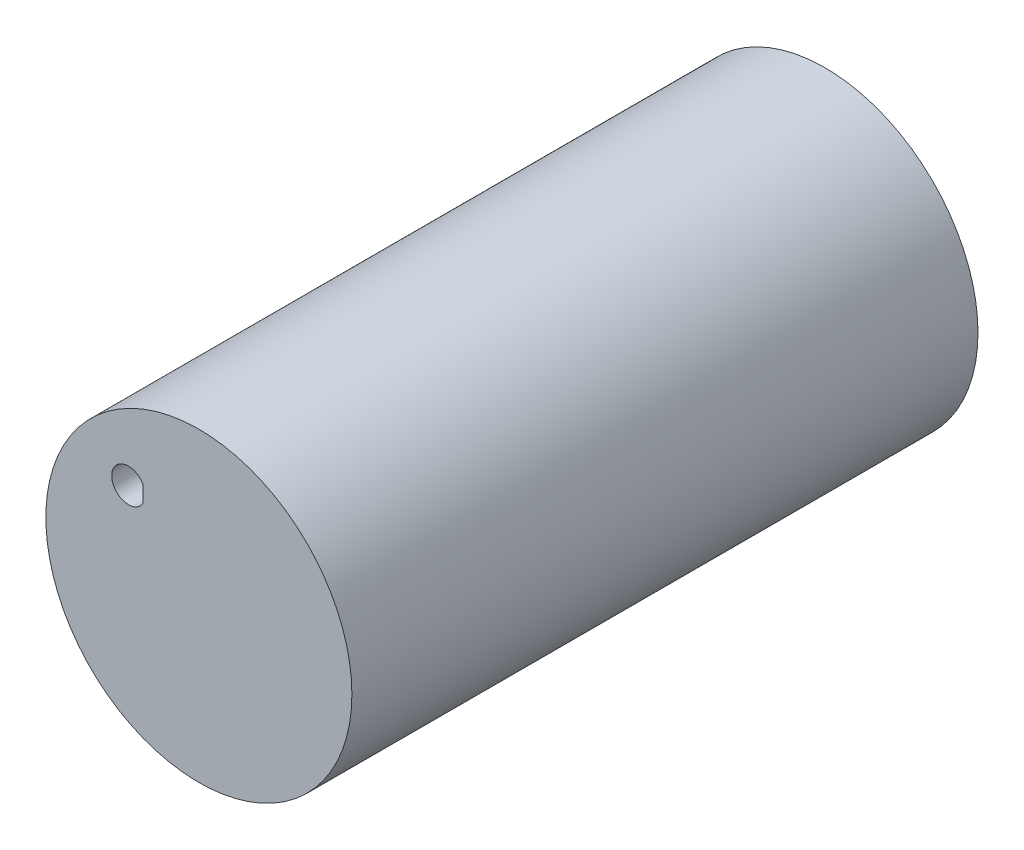
ISO-10303-21;
HEADER;
FILE_DESCRIPTION(('STEP AP214'),'2;1');
FILE_NAME('part.step','',(''),(''),'','','');
FILE_SCHEMA(('AUTOMOTIVE_DESIGN { 1 0 10303 214 1 1 1 1 }'));
ENDSEC;
DATA;
#1=APPLICATION_CONTEXT('core data for automotive mechanical design processes');
#2=APPLICATION_PROTOCOL_DEFINITION('international standard','automotive_design',2000,#1);
#3=PRODUCT_CONTEXT('',#1,'mechanical');
#4=PRODUCT('Part','Part','',(#3));
#5=PRODUCT_RELATED_PRODUCT_CATEGORY('part','',(#4));
#6=PRODUCT_DEFINITION_FORMATION('','',#4);
#7=PRODUCT_DEFINITION_CONTEXT('part definition',#1,'design');
#8=PRODUCT_DEFINITION('design','',#6,#7);
#9=PRODUCT_DEFINITION_SHAPE('','',#8);
#10=(LENGTH_UNIT() NAMED_UNIT(*) SI_UNIT(.MILLI.,.METRE.));
#11=(NAMED_UNIT(*) PLANE_ANGLE_UNIT() SI_UNIT($,.RADIAN.));
#12=(NAMED_UNIT(*) SI_UNIT($,.STERADIAN.) SOLID_ANGLE_UNIT());
#13=UNCERTAINTY_MEASURE_WITH_UNIT(LENGTH_MEASURE(1.E-05),#10,'distance_accuracy_value','');
#14=(GEOMETRIC_REPRESENTATION_CONTEXT(3) GLOBAL_UNCERTAINTY_ASSIGNED_CONTEXT((#13)) GLOBAL_UNIT_ASSIGNED_CONTEXT((#10,
#11,#12)) REPRESENTATION_CONTEXT('',''));
#15=CARTESIAN_POINT('',(0.,0.,0.));
#16=DIRECTION('',(0.,0.,1.));
#17=DIRECTION('',(1.,0.,0.));
#18=AXIS2_PLACEMENT_3D('',#15,#16,#17);
#19=CARTESIAN_POINT('',(0.,0.,118.999));
#20=DIRECTION('',(0.,0.,1.));
#21=DIRECTION('',(1.,0.,0.));
#22=AXIS2_PLACEMENT_3D('',#19,#20,#21);
#23=PLANE('',#22);
#24=CARTESIAN_POINT('',(23.4579025407701,0.,118.999));
#25=DIRECTION('',(0.,0.,1.));
#26=DIRECTION('',(1.,0.,0.));
#27=AXIS2_PLACEMENT_3D('',#24,#25,#26);
#28=CIRCLE('',#27,29.083);
#29=CARTESIAN_POINT('',(52.5409025407701,0.,118.999));
#30=VERTEX_POINT('',#29);
#31=EDGE_CURVE('E11',#30,#30,#28,.T.);
#32=ORIENTED_EDGE('',*,*,#31,.T.);
#33=EDGE_LOOP('',(#32));
#34=FACE_BOUND('',#33,.T.);
#35=CARTESIAN_POINT('',(10.0715826042668,13.1382387185434,118.999));
#36=DIRECTION('',(0.,0.,1.));
#37=DIRECTION('',(1.,0.,0.));
#38=AXIS2_PLACEMENT_3D('',#35,#36,#37);
#39=CIRCLE('',#38,3.175);
#40=CARTESIAN_POINT('',(12.8212132612824,14.7257387185434,118.999));
#41=VERTEX_POINT('',#40);
#42=CARTESIAN_POINT('',(12.8212132612824,11.5507387185434,118.999));
#43=VERTEX_POINT('',#42);
#44=EDGE_CURVE('E69',#41,#43,#39,.T.);
#45=ORIENTED_EDGE('',*,*,#44,.F.);
#46=DIRECTION('',(0.,-1.,0.));
#47=VECTOR('',#46,1.);
#48=CARTESIAN_POINT('',(12.8212132612824,0.,118.999));
#49=LINE('',#48,#47);
#50=EDGE_CURVE('E50',#41,#43,#49,.T.);
#51=ORIENTED_EDGE('',*,*,#50,.T.);
#52=EDGE_LOOP('',(#45,#51));
#53=FACE_BOUND('',#52,.T.);
#54=ADVANCED_FACE('F35',(#34,#53),#23,.T.);
#55=CARTESIAN_POINT('',(0.,0.,0.));
#56=DIRECTION('',(0.,0.,1.));
#57=DIRECTION('',(1.,0.,0.));
#58=AXIS2_PLACEMENT_3D('',#55,#56,#57);
#59=PLANE('',#58);
#60=CARTESIAN_POINT('',(23.4579025407701,0.,0.));
#61=DIRECTION('',(0.,0.,1.));
#62=DIRECTION('',(1.,0.,0.));
#63=AXIS2_PLACEMENT_3D('',#60,#61,#62);
#64=CIRCLE('',#63,29.083);
#65=CARTESIAN_POINT('',(52.5409025407701,0.,0.));
#66=VERTEX_POINT('',#65);
#67=EDGE_CURVE('E39',#66,#66,#64,.T.);
#68=ORIENTED_EDGE('',*,*,#67,.F.);
#69=EDGE_LOOP('',(#68));
#70=FACE_BOUND('',#69,.T.);
#71=DIRECTION('',(0.,-1.,0.));
#72=VECTOR('',#71,1.);
#73=CARTESIAN_POINT('',(12.8212132612824,0.,0.));
#74=LINE('',#73,#72);
#75=CARTESIAN_POINT('',(12.8212132612824,14.7257387185434,0.));
#76=VERTEX_POINT('',#75);
#77=CARTESIAN_POINT('',(12.8212132612824,11.5507387185434,0.));
#78=VERTEX_POINT('',#77);
#79=EDGE_CURVE('E64',#76,#78,#74,.T.);
#80=ORIENTED_EDGE('',*,*,#79,.F.);
#81=CARTESIAN_POINT('',(10.0715826042668,13.1382387185434,0.));
#82=DIRECTION('',(0.,0.,1.));
#83=DIRECTION('',(1.,0.,0.));
#84=AXIS2_PLACEMENT_3D('',#81,#82,#83);
#85=CIRCLE('',#84,3.175);
#86=EDGE_CURVE('E75',#76,#78,#85,.T.);
#87=ORIENTED_EDGE('',*,*,#86,.T.);
#88=EDGE_LOOP('',(#80,#87));
#89=FACE_BOUND('',#88,.T.);
#90=ADVANCED_FACE('F79',(#70,#89),#59,.F.);
#91=CARTESIAN_POINT('',(23.4579025407701,0.,118.999));
#92=DIRECTION('',(0.,0.,-1.));
#93=DIRECTION('',(-1.,0.,0.));
#94=AXIS2_PLACEMENT_3D('',#91,#92,#93);
#95=CYLINDRICAL_SURFACE('',#94,29.083);
#96=ORIENTED_EDGE('',*,*,#31,.F.);
#97=EDGE_LOOP('',(#96));
#98=FACE_BOUND('',#97,.T.);
#99=ORIENTED_EDGE('',*,*,#67,.T.);
#100=EDGE_LOOP('',(#99));
#101=FACE_BOUND('',#100,.T.);
#102=ADVANCED_FACE('F37',(#98,#101),#95,.T.);
#103=CARTESIAN_POINT('',(12.8212132612824,0.,0.));
#104=DIRECTION('',(-1.,0.,0.));
#105=DIRECTION('',(0.,0.,1.));
#106=AXIS2_PLACEMENT_3D('',#103,#104,#105);
#107=PLANE('',#106);
#108=ORIENTED_EDGE('',*,*,#50,.F.);
#109=DIRECTION('',(0.,0.,1.));
#110=VECTOR('',#109,1.);
#111=CARTESIAN_POINT('',(12.8212132612824,14.7257387185434,0.));
#112=LINE('',#111,#110);
#113=EDGE_CURVE('E66',#76,#41,#112,.T.);
#114=ORIENTED_EDGE('',*,*,#113,.F.);
#115=ORIENTED_EDGE('',*,*,#79,.T.);
#116=DIRECTION('',(0.,0.,1.));
#117=VECTOR('',#116,1.);
#118=CARTESIAN_POINT('',(12.8212132612824,11.5507387185434,0.));
#119=LINE('',#118,#117);
#120=EDGE_CURVE('E57',#78,#43,#119,.T.);
#121=ORIENTED_EDGE('',*,*,#120,.T.);
#122=EDGE_LOOP('',(#108,#114,#115,#121));
#123=FACE_BOUND('',#122,.T.);
#124=ADVANCED_FACE('F62',(#123),#107,.T.);
#125=CARTESIAN_POINT('',(10.0715826042668,13.1382387185434,0.));
#126=DIRECTION('',(0.,0.,1.));
#127=DIRECTION('',(1.,0.,0.));
#128=AXIS2_PLACEMENT_3D('',#125,#126,#127);
#129=CYLINDRICAL_SURFACE('',#128,3.175);
#130=ORIENTED_EDGE('',*,*,#44,.T.);
#131=ORIENTED_EDGE('',*,*,#120,.F.);
#132=ORIENTED_EDGE('',*,*,#86,.F.);
#133=ORIENTED_EDGE('',*,*,#113,.T.);
#134=EDGE_LOOP('',(#130,#131,#132,#133));
#135=FACE_BOUND('',#134,.T.);
#136=ADVANCED_FACE('F70',(#135),#129,.F.);
#137=CLOSED_SHELL('',(#54,#90,#102,#124,#136));
#138=MANIFOLD_SOLID_BREP('B2',#137);
#139=ADVANCED_BREP_SHAPE_REPRESENTATION('',(#18,#138),#14);
#140=SHAPE_DEFINITION_REPRESENTATION(#9,#139);
ENDSEC;
END-ISO-10303-21;
